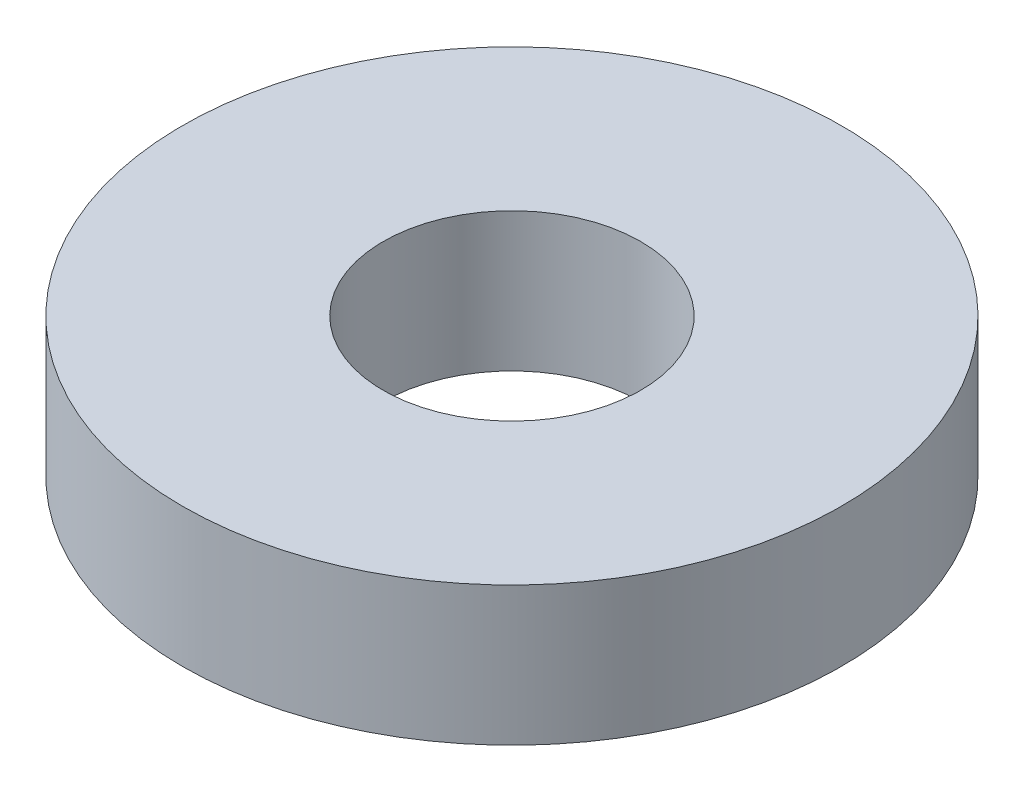
ISO-10303-21;
HEADER;
FILE_DESCRIPTION(('STEP AP214'),'2;1');
FILE_NAME('part.step','',(''),(''),'','','');
FILE_SCHEMA(('AUTOMOTIVE_DESIGN { 1 0 10303 214 1 1 1 1 }'));
ENDSEC;
DATA;
#1=APPLICATION_CONTEXT('core data for automotive mechanical design processes');
#2=APPLICATION_PROTOCOL_DEFINITION('international standard','automotive_design',2000,#1);
#3=PRODUCT_CONTEXT('',#1,'mechanical');
#4=PRODUCT('Part','Part','',(#3));
#5=PRODUCT_RELATED_PRODUCT_CATEGORY('part','',(#4));
#6=PRODUCT_DEFINITION_FORMATION('','',#4);
#7=PRODUCT_DEFINITION_CONTEXT('part definition',#1,'design');
#8=PRODUCT_DEFINITION('design','',#6,#7);
#9=PRODUCT_DEFINITION_SHAPE('','',#8);
#10=(LENGTH_UNIT() NAMED_UNIT(*) SI_UNIT(.MILLI.,.METRE.));
#11=(NAMED_UNIT(*) PLANE_ANGLE_UNIT() SI_UNIT($,.RADIAN.));
#12=(NAMED_UNIT(*) SI_UNIT($,.STERADIAN.) SOLID_ANGLE_UNIT());
#13=UNCERTAINTY_MEASURE_WITH_UNIT(LENGTH_MEASURE(1.E-05),#10,'distance_accuracy_value','');
#14=(GEOMETRIC_REPRESENTATION_CONTEXT(3) GLOBAL_UNCERTAINTY_ASSIGNED_CONTEXT((#13)) GLOBAL_UNIT_ASSIGNED_CONTEXT((#10,
#11,#12)) REPRESENTATION_CONTEXT('',''));
#15=CARTESIAN_POINT('',(0.,0.,0.));
#16=DIRECTION('',(0.,0.,1.));
#17=DIRECTION('',(1.,0.,0.));
#18=AXIS2_PLACEMENT_3D('',#15,#16,#17);
#19=CARTESIAN_POINT('',(0.,3.556,0.));
#20=DIRECTION('',(0.,-1.,0.));
#21=DIRECTION('',(0.,0.,-1.));
#22=AXIS2_PLACEMENT_3D('',#19,#20,#21);
#23=CYLINDRICAL_SURFACE('',#22,8.4455);
#24=CARTESIAN_POINT('',(0.,3.556,0.));
#25=DIRECTION('',(0.,1.,0.));
#26=DIRECTION('',(0.,0.,1.));
#27=AXIS2_PLACEMENT_3D('',#24,#25,#26);
#28=CIRCLE('',#27,8.4455);
#29=CARTESIAN_POINT('',(0.,3.556,8.4455));
#30=VERTEX_POINT('',#29);
#31=EDGE_CURVE('E10',#30,#30,#28,.T.);
#32=ORIENTED_EDGE('',*,*,#31,.F.);
#33=EDGE_LOOP('',(#32));
#34=FACE_BOUND('',#33,.T.);
#35=CARTESIAN_POINT('',(0.,0.,0.));
#36=DIRECTION('',(0.,1.,0.));
#37=DIRECTION('',(0.,0.,1.));
#38=AXIS2_PLACEMENT_3D('',#35,#36,#37);
#39=CIRCLE('',#38,8.4455);
#40=CARTESIAN_POINT('',(0.,0.,8.4455));
#41=VERTEX_POINT('',#40);
#42=EDGE_CURVE('E34',#41,#41,#39,.T.);
#43=ORIENTED_EDGE('',*,*,#42,.T.);
#44=EDGE_LOOP('',(#43));
#45=FACE_BOUND('',#44,.T.);
#46=ADVANCED_FACE('F31',(#34,#45),#23,.T.);
#47=CARTESIAN_POINT('',(0.,3.556,0.));
#48=DIRECTION('',(0.,1.,0.));
#49=DIRECTION('',(0.,0.,1.));
#50=AXIS2_PLACEMENT_3D('',#47,#48,#49);
#51=PLANE('',#50);
#52=CARTESIAN_POINT('',(0.,3.556,0.));
#53=DIRECTION('',(0.,-1.,0.));
#54=DIRECTION('',(0.,0.,-1.));
#55=AXIS2_PLACEMENT_3D('',#52,#53,#54);
#56=CIRCLE('',#55,3.302);
#57=CARTESIAN_POINT('',(0.,3.556,-3.302));
#58=VERTEX_POINT('',#57);
#59=EDGE_CURVE('E41',#58,#58,#56,.T.);
#60=ORIENTED_EDGE('',*,*,#59,.T.);
#61=EDGE_LOOP('',(#60));
#62=FACE_BOUND('',#61,.T.);
#63=ORIENTED_EDGE('',*,*,#31,.T.);
#64=EDGE_LOOP('',(#63));
#65=FACE_BOUND('',#64,.T.);
#66=ADVANCED_FACE('F49',(#62,#65),#51,.T.);
#67=CARTESIAN_POINT('',(0.,0.,0.));
#68=DIRECTION('',(0.,1.,0.));
#69=DIRECTION('',(0.,0.,1.));
#70=AXIS2_PLACEMENT_3D('',#67,#68,#69);
#71=PLANE('',#70);
#72=CARTESIAN_POINT('',(0.,0.,0.));
#73=DIRECTION('',(0.,-1.,0.));
#74=DIRECTION('',(0.,0.,-1.));
#75=AXIS2_PLACEMENT_3D('',#72,#73,#74);
#76=CIRCLE('',#75,3.302);
#77=CARTESIAN_POINT('',(0.,0.,-3.302));
#78=VERTEX_POINT('',#77);
#79=EDGE_CURVE('E43',#78,#78,#76,.T.);
#80=ORIENTED_EDGE('',*,*,#79,.F.);
#81=EDGE_LOOP('',(#80));
#82=FACE_BOUND('',#81,.T.);
#83=ORIENTED_EDGE('',*,*,#42,.F.);
#84=EDGE_LOOP('',(#83));
#85=FACE_BOUND('',#84,.T.);
#86=ADVANCED_FACE('F54',(#82,#85),#71,.F.);
#87=CARTESIAN_POINT('',(0.,3.556,0.));
#88=DIRECTION('',(0.,-1.,0.));
#89=DIRECTION('',(0.,0.,-1.));
#90=AXIS2_PLACEMENT_3D('',#87,#88,#89);
#91=CYLINDRICAL_SURFACE('',#90,3.302);
#92=ORIENTED_EDGE('',*,*,#59,.F.);
#93=EDGE_LOOP('',(#92));
#94=FACE_BOUND('',#93,.T.);
#95=ORIENTED_EDGE('',*,*,#79,.T.);
#96=EDGE_LOOP('',(#95));
#97=FACE_BOUND('',#96,.T.);
#98=ADVANCED_FACE('F51',(#94,#97),#91,.F.);
#99=CLOSED_SHELL('',(#46,#66,#86,#98));
#100=MANIFOLD_SOLID_BREP('B2',#99);
#101=ADVANCED_BREP_SHAPE_REPRESENTATION('',(#18,#100),#14);
#102=SHAPE_DEFINITION_REPRESENTATION(#9,#101);
ENDSEC;
END-ISO-10303-21;
